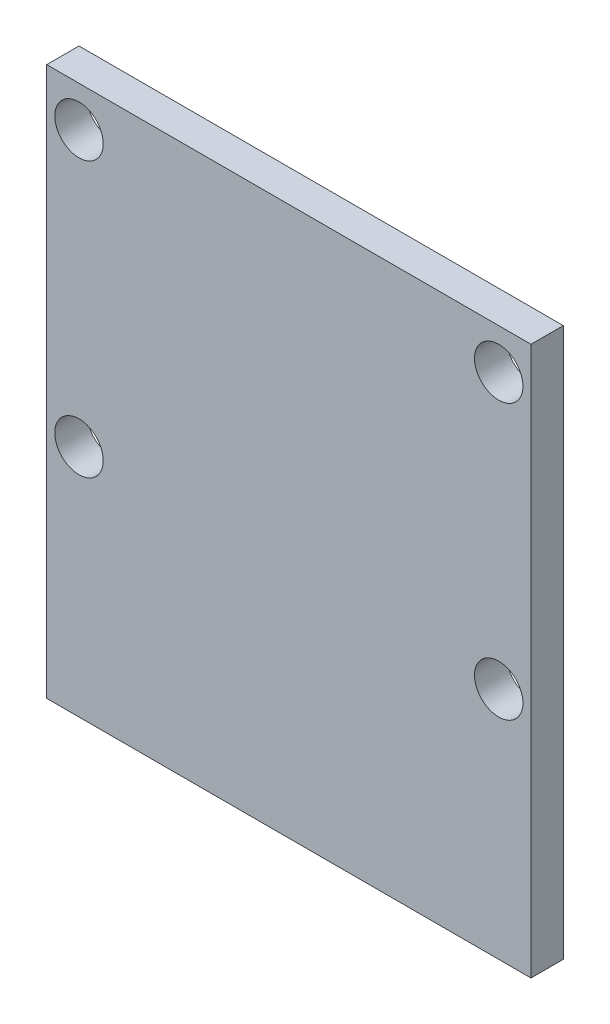
ISO-10303-21;
HEADER;
FILE_DESCRIPTION(('STEP AP214'),'2;1');
FILE_NAME('part.step','',(''),(''),'','','');
FILE_SCHEMA(('AUTOMOTIVE_DESIGN { 1 0 10303 214 1 1 1 1 }'));
ENDSEC;
DATA;
#1=APPLICATION_CONTEXT('core data for automotive mechanical design processes');
#2=APPLICATION_PROTOCOL_DEFINITION('international standard','automotive_design',2000,#1);
#3=PRODUCT_CONTEXT('',#1,'mechanical');
#4=PRODUCT('Part','Part','',(#3));
#5=PRODUCT_RELATED_PRODUCT_CATEGORY('part','',(#4));
#6=PRODUCT_DEFINITION_FORMATION('','',#4);
#7=PRODUCT_DEFINITION_CONTEXT('part definition',#1,'design');
#8=PRODUCT_DEFINITION('design','',#6,#7);
#9=PRODUCT_DEFINITION_SHAPE('','',#8);
#10=(LENGTH_UNIT() NAMED_UNIT(*) SI_UNIT(.MILLI.,.METRE.));
#11=(NAMED_UNIT(*) PLANE_ANGLE_UNIT() SI_UNIT($,.RADIAN.));
#12=(NAMED_UNIT(*) SI_UNIT($,.STERADIAN.) SOLID_ANGLE_UNIT());
#13=UNCERTAINTY_MEASURE_WITH_UNIT(LENGTH_MEASURE(1.E-05),#10,'distance_accuracy_value','');
#14=(GEOMETRIC_REPRESENTATION_CONTEXT(3) GLOBAL_UNCERTAINTY_ASSIGNED_CONTEXT((#13)) GLOBAL_UNIT_ASSIGNED_CONTEXT((#10,
#11,#12)) REPRESENTATION_CONTEXT('',''));
#15=CARTESIAN_POINT('',(0.,0.,0.));
#16=DIRECTION('',(0.,0.,1.));
#17=DIRECTION('',(1.,0.,0.));
#18=AXIS2_PLACEMENT_3D('',#15,#16,#17);
#19=CARTESIAN_POINT('',(0.,0.,2.));
#20=DIRECTION('',(0.,0.,-1.));
#21=DIRECTION('',(-1.,0.,0.));
#22=AXIS2_PLACEMENT_3D('',#19,#20,#21);
#23=PLANE('',#22);
#24=DIRECTION('',(0.,1.,0.));
#25=VECTOR('',#24,1.);
#26=CARTESIAN_POINT('',(15.,-17.,2.));
#27=LINE('',#26,#25);
#28=CARTESIAN_POINT('',(15.,-17.,2.));
#29=VERTEX_POINT('',#28);
#30=CARTESIAN_POINT('',(15.,17.,2.));
#31=VERTEX_POINT('',#30);
#32=EDGE_CURVE('E84',#29,#31,#27,.T.);
#33=ORIENTED_EDGE('',*,*,#32,.T.);
#34=DIRECTION('',(-1.,0.,0.));
#35=VECTOR('',#34,1.);
#36=CARTESIAN_POINT('',(-15.,17.,2.));
#37=LINE('',#36,#35);
#38=CARTESIAN_POINT('',(-15.,17.,2.));
#39=VERTEX_POINT('',#38);
#40=EDGE_CURVE('E79',#31,#39,#37,.T.);
#41=ORIENTED_EDGE('',*,*,#40,.T.);
#42=DIRECTION('',(0.,-1.,0.));
#43=VECTOR('',#42,1.);
#44=CARTESIAN_POINT('',(-15.,-17.,2.));
#45=LINE('',#44,#43);
#46=CARTESIAN_POINT('',(-15.,-17.,2.));
#47=VERTEX_POINT('',#46);
#48=EDGE_CURVE('E82',#39,#47,#45,.T.);
#49=ORIENTED_EDGE('',*,*,#48,.T.);
#50=DIRECTION('',(1.,0.,0.));
#51=VECTOR('',#50,1.);
#52=CARTESIAN_POINT('',(-15.,-17.,2.));
#53=LINE('',#52,#51);
#54=EDGE_CURVE('E49',#47,#29,#53,.T.);
#55=ORIENTED_EDGE('',*,*,#54,.T.);
#56=EDGE_LOOP('',(#33,#41,#49,#55));
#57=FACE_BOUND('',#56,.T.);
#58=CARTESIAN_POINT('',(-13.,14.5,2.));
#59=DIRECTION('',(0.,0.,1.));
#60=DIRECTION('',(1.,0.,0.));
#61=AXIS2_PLACEMENT_3D('',#58,#59,#60);
#62=CIRCLE('',#61,1.5);
#63=CARTESIAN_POINT('',(-11.5,14.5,2.));
#64=VERTEX_POINT('',#63);
#65=EDGE_CURVE('E99',#64,#64,#62,.T.);
#66=ORIENTED_EDGE('',*,*,#65,.F.);
#67=EDGE_LOOP('',(#66));
#68=FACE_BOUND('',#67,.T.);
#69=CARTESIAN_POINT('',(13.,14.5,2.));
#70=DIRECTION('',(0.,0.,1.));
#71=DIRECTION('',(1.,0.,0.));
#72=AXIS2_PLACEMENT_3D('',#69,#70,#71);
#73=CIRCLE('',#72,1.5);
#74=CARTESIAN_POINT('',(14.5,14.5,2.));
#75=VERTEX_POINT('',#74);
#76=EDGE_CURVE('E114',#75,#75,#73,.T.);
#77=ORIENTED_EDGE('',*,*,#76,.F.);
#78=EDGE_LOOP('',(#77));
#79=FACE_BOUND('',#78,.T.);
#80=CARTESIAN_POINT('',(-13.,-2.49999999999999,2.));
#81=DIRECTION('',(0.,0.,1.));
#82=DIRECTION('',(1.,0.,0.));
#83=AXIS2_PLACEMENT_3D('',#80,#81,#82);
#84=CIRCLE('',#83,1.5);
#85=CARTESIAN_POINT('',(-11.5,-2.49999999999999,2.));
#86=VERTEX_POINT('',#85);
#87=EDGE_CURVE('E120',#86,#86,#84,.T.);
#88=ORIENTED_EDGE('',*,*,#87,.F.);
#89=EDGE_LOOP('',(#88));
#90=FACE_BOUND('',#89,.T.);
#91=CARTESIAN_POINT('',(13.,-2.49999999999999,2.));
#92=DIRECTION('',(0.,0.,1.));
#93=DIRECTION('',(1.,0.,0.));
#94=AXIS2_PLACEMENT_3D('',#91,#92,#93);
#95=CIRCLE('',#94,1.5);
#96=CARTESIAN_POINT('',(14.5,-2.49999999999999,2.));
#97=VERTEX_POINT('',#96);
#98=EDGE_CURVE('E126',#97,#97,#95,.T.);
#99=ORIENTED_EDGE('',*,*,#98,.F.);
#100=EDGE_LOOP('',(#99));
#101=FACE_BOUND('',#100,.T.);
#102=ADVANCED_FACE('F32',(#57,#68,#79,#90,#101),#23,.F.);
#103=CARTESIAN_POINT('',(0.,0.,0.));
#104=DIRECTION('',(0.,0.,-1.));
#105=DIRECTION('',(-1.,0.,0.));
#106=AXIS2_PLACEMENT_3D('',#103,#104,#105);
#107=PLANE('',#106);
#108=CARTESIAN_POINT('',(-13.,-2.49999999999999,0.));
#109=DIRECTION('',(0.,0.,1.));
#110=DIRECTION('',(1.,0.,0.));
#111=AXIS2_PLACEMENT_3D('',#108,#109,#110);
#112=CIRCLE('',#111,1.5);
#113=CARTESIAN_POINT('',(-11.5,-2.49999999999999,0.));
#114=VERTEX_POINT('',#113);
#115=EDGE_CURVE('E123',#114,#114,#112,.T.);
#116=ORIENTED_EDGE('',*,*,#115,.T.);
#117=EDGE_LOOP('',(#116));
#118=FACE_BOUND('',#117,.T.);
#119=CARTESIAN_POINT('',(-13.,14.5,0.));
#120=DIRECTION('',(0.,0.,1.));
#121=DIRECTION('',(1.,0.,0.));
#122=AXIS2_PLACEMENT_3D('',#119,#120,#121);
#123=CIRCLE('',#122,1.5);
#124=CARTESIAN_POINT('',(-11.5,14.5,0.));
#125=VERTEX_POINT('',#124);
#126=EDGE_CURVE('E111',#125,#125,#123,.T.);
#127=ORIENTED_EDGE('',*,*,#126,.T.);
#128=EDGE_LOOP('',(#127));
#129=FACE_BOUND('',#128,.T.);
#130=DIRECTION('',(0.,1.,0.));
#131=VECTOR('',#130,1.);
#132=CARTESIAN_POINT('',(15.,-17.,0.));
#133=LINE('',#132,#131);
#134=CARTESIAN_POINT('',(15.,-17.,0.));
#135=VERTEX_POINT('',#134);
#136=CARTESIAN_POINT('',(15.,17.,0.));
#137=VERTEX_POINT('',#136);
#138=EDGE_CURVE('E96',#135,#137,#133,.T.);
#139=ORIENTED_EDGE('',*,*,#138,.F.);
#140=DIRECTION('',(1.,0.,0.));
#141=VECTOR('',#140,1.);
#142=CARTESIAN_POINT('',(-15.,-17.,0.));
#143=LINE('',#142,#141);
#144=CARTESIAN_POINT('',(-15.,-17.,0.));
#145=VERTEX_POINT('',#144);
#146=EDGE_CURVE('E72',#145,#135,#143,.T.);
#147=ORIENTED_EDGE('',*,*,#146,.F.);
#148=DIRECTION('',(0.,-1.,0.));
#149=VECTOR('',#148,1.);
#150=CARTESIAN_POINT('',(-15.,-17.,0.));
#151=LINE('',#150,#149);
#152=CARTESIAN_POINT('',(-15.,17.,0.));
#153=VERTEX_POINT('',#152);
#154=EDGE_CURVE('E66',#153,#145,#151,.T.);
#155=ORIENTED_EDGE('',*,*,#154,.F.);
#156=DIRECTION('',(-1.,0.,0.));
#157=VECTOR('',#156,1.);
#158=CARTESIAN_POINT('',(-15.,17.,0.));
#159=LINE('',#158,#157);
#160=EDGE_CURVE('E88',#137,#153,#159,.T.);
#161=ORIENTED_EDGE('',*,*,#160,.F.);
#162=EDGE_LOOP('',(#139,#147,#155,#161));
#163=FACE_BOUND('',#162,.T.);
#164=CARTESIAN_POINT('',(13.,14.5,0.));
#165=DIRECTION('',(0.,0.,1.));
#166=DIRECTION('',(1.,0.,0.));
#167=AXIS2_PLACEMENT_3D('',#164,#165,#166);
#168=CIRCLE('',#167,1.5);
#169=CARTESIAN_POINT('',(14.5,14.5,0.));
#170=VERTEX_POINT('',#169);
#171=EDGE_CURVE('E117',#170,#170,#168,.T.);
#172=ORIENTED_EDGE('',*,*,#171,.T.);
#173=EDGE_LOOP('',(#172));
#174=FACE_BOUND('',#173,.T.);
#175=CARTESIAN_POINT('',(13.,-2.49999999999999,0.));
#176=DIRECTION('',(0.,0.,1.));
#177=DIRECTION('',(1.,0.,0.));
#178=AXIS2_PLACEMENT_3D('',#175,#176,#177);
#179=CIRCLE('',#178,1.5);
#180=CARTESIAN_POINT('',(14.5,-2.49999999999999,0.));
#181=VERTEX_POINT('',#180);
#182=EDGE_CURVE('E129',#181,#181,#179,.T.);
#183=ORIENTED_EDGE('',*,*,#182,.T.);
#184=EDGE_LOOP('',(#183));
#185=FACE_BOUND('',#184,.T.);
#186=ADVANCED_FACE('F107',(#118,#129,#163,#174,#185),#107,.T.);
#187=CARTESIAN_POINT('',(15.,-17.,2.));
#188=DIRECTION('',(-1.,0.,0.));
#189=DIRECTION('',(0.,0.,1.));
#190=AXIS2_PLACEMENT_3D('',#187,#188,#189);
#191=PLANE('',#190);
#192=ORIENTED_EDGE('',*,*,#138,.T.);
#193=DIRECTION('',(0.,0.,-1.));
#194=VECTOR('',#193,1.);
#195=CARTESIAN_POINT('',(15.,17.,2.));
#196=LINE('',#195,#194);
#197=EDGE_CURVE('E11',#31,#137,#196,.T.);
#198=ORIENTED_EDGE('',*,*,#197,.F.);
#199=ORIENTED_EDGE('',*,*,#32,.F.);
#200=DIRECTION('',(0.,0.,-1.));
#201=VECTOR('',#200,1.);
#202=CARTESIAN_POINT('',(15.,-17.,2.));
#203=LINE('',#202,#201);
#204=EDGE_CURVE('E92',#29,#135,#203,.T.);
#205=ORIENTED_EDGE('',*,*,#204,.T.);
#206=EDGE_LOOP('',(#192,#198,#199,#205));
#207=FACE_BOUND('',#206,.T.);
#208=ADVANCED_FACE('F34',(#207),#191,.F.);
#209=CARTESIAN_POINT('',(-15.,17.,2.));
#210=DIRECTION('',(0.,-1.,0.));
#211=DIRECTION('',(0.,0.,-1.));
#212=AXIS2_PLACEMENT_3D('',#209,#210,#211);
#213=PLANE('',#212);
#214=ORIENTED_EDGE('',*,*,#160,.T.);
#215=DIRECTION('',(0.,0.,-1.));
#216=VECTOR('',#215,1.);
#217=CARTESIAN_POINT('',(-15.,17.,2.));
#218=LINE('',#217,#216);
#219=EDGE_CURVE('E41',#39,#153,#218,.T.);
#220=ORIENTED_EDGE('',*,*,#219,.F.);
#221=ORIENTED_EDGE('',*,*,#40,.F.);
#222=ORIENTED_EDGE('',*,*,#197,.T.);
#223=EDGE_LOOP('',(#214,#220,#221,#222));
#224=FACE_BOUND('',#223,.T.);
#225=ADVANCED_FACE('F87',(#224),#213,.F.);
#226=CARTESIAN_POINT('',(-15.,-17.,2.));
#227=DIRECTION('',(1.,0.,0.));
#228=DIRECTION('',(0.,0.,-1.));
#229=AXIS2_PLACEMENT_3D('',#226,#227,#228);
#230=PLANE('',#229);
#231=ORIENTED_EDGE('',*,*,#154,.T.);
#232=DIRECTION('',(0.,0.,-1.));
#233=VECTOR('',#232,1.);
#234=CARTESIAN_POINT('',(-15.,-17.,2.));
#235=LINE('',#234,#233);
#236=EDGE_CURVE('E89',#47,#145,#235,.T.);
#237=ORIENTED_EDGE('',*,*,#236,.F.);
#238=ORIENTED_EDGE('',*,*,#48,.F.);
#239=ORIENTED_EDGE('',*,*,#219,.T.);
#240=EDGE_LOOP('',(#231,#237,#238,#239));
#241=FACE_BOUND('',#240,.T.);
#242=ADVANCED_FACE('F90',(#241),#230,.F.);
#243=CARTESIAN_POINT('',(-15.,-17.,2.));
#244=DIRECTION('',(0.,1.,0.));
#245=DIRECTION('',(0.,0.,1.));
#246=AXIS2_PLACEMENT_3D('',#243,#244,#245);
#247=PLANE('',#246);
#248=ORIENTED_EDGE('',*,*,#146,.T.);
#249=ORIENTED_EDGE('',*,*,#204,.F.);
#250=ORIENTED_EDGE('',*,*,#54,.F.);
#251=ORIENTED_EDGE('',*,*,#236,.T.);
#252=EDGE_LOOP('',(#248,#249,#250,#251));
#253=FACE_BOUND('',#252,.T.);
#254=ADVANCED_FACE('F104',(#253),#247,.F.);
#255=CARTESIAN_POINT('',(-13.,14.5,2.));
#256=DIRECTION('',(0.,0.,-1.));
#257=DIRECTION('',(-1.,0.,0.));
#258=AXIS2_PLACEMENT_3D('',#255,#256,#257);
#259=CYLINDRICAL_SURFACE('',#258,1.5);
#260=ORIENTED_EDGE('',*,*,#65,.T.);
#261=EDGE_LOOP('',(#260));
#262=FACE_BOUND('',#261,.T.);
#263=ORIENTED_EDGE('',*,*,#126,.F.);
#264=EDGE_LOOP('',(#263));
#265=FACE_BOUND('',#264,.T.);
#266=ADVANCED_FACE('F146',(#262,#265),#259,.F.);
#267=CARTESIAN_POINT('',(13.,14.5,2.));
#268=DIRECTION('',(0.,0.,-1.));
#269=DIRECTION('',(-1.,0.,0.));
#270=AXIS2_PLACEMENT_3D('',#267,#268,#269);
#271=CYLINDRICAL_SURFACE('',#270,1.5);
#272=ORIENTED_EDGE('',*,*,#76,.T.);
#273=EDGE_LOOP('',(#272));
#274=FACE_BOUND('',#273,.T.);
#275=ORIENTED_EDGE('',*,*,#171,.F.);
#276=EDGE_LOOP('',(#275));
#277=FACE_BOUND('',#276,.T.);
#278=ADVANCED_FACE('F192',(#274,#277),#271,.F.);
#279=CARTESIAN_POINT('',(-13.,-2.49999999999999,2.));
#280=DIRECTION('',(0.,0.,-1.));
#281=DIRECTION('',(-1.,0.,0.));
#282=AXIS2_PLACEMENT_3D('',#279,#280,#281);
#283=CYLINDRICAL_SURFACE('',#282,1.5);
#284=ORIENTED_EDGE('',*,*,#87,.T.);
#285=EDGE_LOOP('',(#284));
#286=FACE_BOUND('',#285,.T.);
#287=ORIENTED_EDGE('',*,*,#115,.F.);
#288=EDGE_LOOP('',(#287));
#289=FACE_BOUND('',#288,.T.);
#290=ADVANCED_FACE('F200',(#286,#289),#283,.F.);
#291=CARTESIAN_POINT('',(13.,-2.49999999999999,2.));
#292=DIRECTION('',(0.,0.,-1.));
#293=DIRECTION('',(-1.,0.,0.));
#294=AXIS2_PLACEMENT_3D('',#291,#292,#293);
#295=CYLINDRICAL_SURFACE('',#294,1.5);
#296=ORIENTED_EDGE('',*,*,#98,.T.);
#297=EDGE_LOOP('',(#296));
#298=FACE_BOUND('',#297,.T.);
#299=ORIENTED_EDGE('',*,*,#182,.F.);
#300=EDGE_LOOP('',(#299));
#301=FACE_BOUND('',#300,.T.);
#302=ADVANCED_FACE('F135',(#298,#301),#295,.F.);
#303=CLOSED_SHELL('',(#102,#186,#208,#225,#242,#254,#266,#278,#290,#302));
#304=MANIFOLD_SOLID_BREP('B2',#303);
#305=ADVANCED_BREP_SHAPE_REPRESENTATION('',(#18,#304),#14);
#306=SHAPE_DEFINITION_REPRESENTATION(#9,#305);
ENDSEC;
END-ISO-10303-21;
